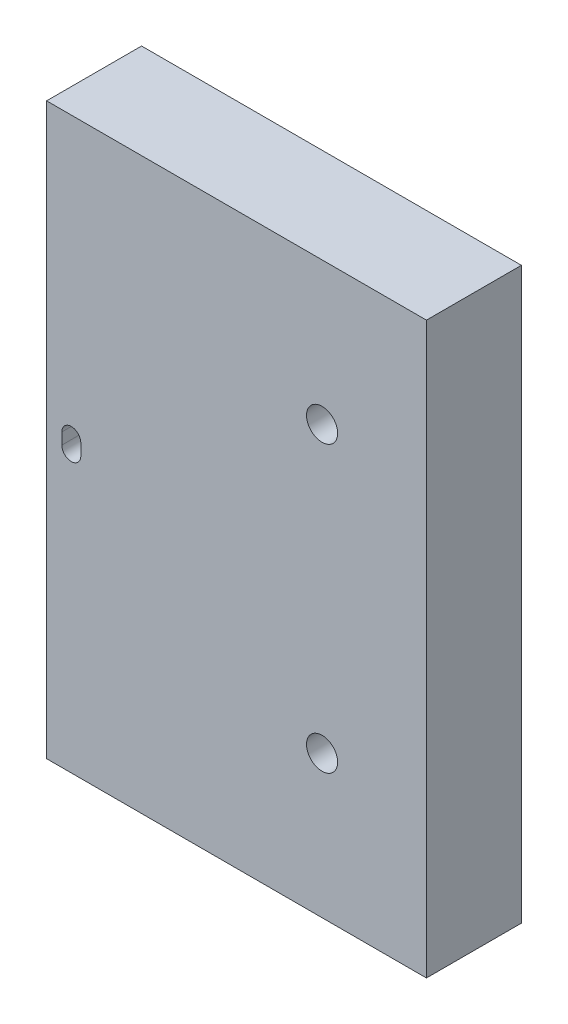
ISO-10303-21;
HEADER;
FILE_DESCRIPTION(('STEP AP214'),'2;1');
FILE_NAME('part.step','',(''),(''),'','','');
FILE_SCHEMA(('AUTOMOTIVE_DESIGN { 1 0 10303 214 1 1 1 1 }'));
ENDSEC;
DATA;
#1=APPLICATION_CONTEXT('core data for automotive mechanical design processes');
#2=APPLICATION_PROTOCOL_DEFINITION('international standard','automotive_design',2000,#1);
#3=PRODUCT_CONTEXT('',#1,'mechanical');
#4=PRODUCT('Part','Part','',(#3));
#5=PRODUCT_RELATED_PRODUCT_CATEGORY('part','',(#4));
#6=PRODUCT_DEFINITION_FORMATION('','',#4);
#7=PRODUCT_DEFINITION_CONTEXT('part definition',#1,'design');
#8=PRODUCT_DEFINITION('design','',#6,#7);
#9=PRODUCT_DEFINITION_SHAPE('','',#8);
#10=(LENGTH_UNIT() NAMED_UNIT(*) SI_UNIT(.MILLI.,.METRE.));
#11=(NAMED_UNIT(*) PLANE_ANGLE_UNIT() SI_UNIT($,.RADIAN.));
#12=(NAMED_UNIT(*) SI_UNIT($,.STERADIAN.) SOLID_ANGLE_UNIT());
#13=UNCERTAINTY_MEASURE_WITH_UNIT(LENGTH_MEASURE(1.E-05),#10,'distance_accuracy_value','');
#14=(GEOMETRIC_REPRESENTATION_CONTEXT(3) GLOBAL_UNCERTAINTY_ASSIGNED_CONTEXT((#13)) GLOBAL_UNIT_ASSIGNED_CONTEXT((#10,
#11,#12)) REPRESENTATION_CONTEXT('',''));
#15=CARTESIAN_POINT('',(0.,0.,0.));
#16=DIRECTION('',(0.,0.,1.));
#17=DIRECTION('',(1.,0.,0.));
#18=AXIS2_PLACEMENT_3D('',#15,#16,#17);
#19=CARTESIAN_POINT('',(12.7,-19.05,6.35));
#20=DIRECTION('',(-1.,0.,0.));
#21=DIRECTION('',(0.,0.,1.));
#22=AXIS2_PLACEMENT_3D('',#19,#20,#21);
#23=PLANE('',#22);
#24=DIRECTION('',(0.,1.,0.));
#25=VECTOR('',#24,1.);
#26=CARTESIAN_POINT('',(12.7,-19.05,0.));
#27=LINE('',#26,#25);
#28=CARTESIAN_POINT('',(12.7,-19.05,0.));
#29=VERTEX_POINT('',#28);
#30=CARTESIAN_POINT('',(12.7,19.05,0.));
#31=VERTEX_POINT('',#30);
#32=EDGE_CURVE('E154',#29,#31,#27,.T.);
#33=ORIENTED_EDGE('',*,*,#32,.T.);
#34=DIRECTION('',(0.,0.,-1.));
#35=VECTOR('',#34,1.);
#36=CARTESIAN_POINT('',(12.7,19.05,6.35));
#37=LINE('',#36,#35);
#38=CARTESIAN_POINT('',(12.7,19.05,6.35));
#39=VERTEX_POINT('',#38);
#40=EDGE_CURVE('E11',#39,#31,#37,.T.);
#41=ORIENTED_EDGE('',*,*,#40,.F.);
#42=DIRECTION('',(0.,1.,0.));
#43=VECTOR('',#42,1.);
#44=CARTESIAN_POINT('',(12.7,-19.05,6.35));
#45=LINE('',#44,#43);
#46=CARTESIAN_POINT('',(12.7,-19.05,6.35));
#47=VERTEX_POINT('',#46);
#48=EDGE_CURVE('E155',#47,#39,#45,.T.);
#49=ORIENTED_EDGE('',*,*,#48,.F.);
#50=DIRECTION('',(0.,0.,-1.));
#51=VECTOR('',#50,1.);
#52=CARTESIAN_POINT('',(12.7,-19.05,6.35));
#53=LINE('',#52,#51);
#54=EDGE_CURVE('E165',#47,#29,#53,.T.);
#55=ORIENTED_EDGE('',*,*,#54,.T.);
#56=EDGE_LOOP('',(#33,#41,#49,#55));
#57=FACE_BOUND('',#56,.T.);
#58=ADVANCED_FACE('F33',(#57),#23,.F.);
#59=CARTESIAN_POINT('',(-12.7,19.05,6.35));
#60=DIRECTION('',(0.,-1.,0.));
#61=DIRECTION('',(0.,0.,-1.));
#62=AXIS2_PLACEMENT_3D('',#59,#60,#61);
#63=PLANE('',#62);
#64=DIRECTION('',(-1.,0.,0.));
#65=VECTOR('',#64,1.);
#66=CARTESIAN_POINT('',(-12.7,19.05,0.));
#67=LINE('',#66,#65);
#68=CARTESIAN_POINT('',(-12.7,19.05,0.));
#69=VERTEX_POINT('',#68);
#70=EDGE_CURVE('E168',#31,#69,#67,.T.);
#71=ORIENTED_EDGE('',*,*,#70,.T.);
#72=DIRECTION('',(0.,0.,-1.));
#73=VECTOR('',#72,1.);
#74=CARTESIAN_POINT('',(-12.7,19.05,6.35));
#75=LINE('',#74,#73);
#76=CARTESIAN_POINT('',(-12.7,19.05,6.35));
#77=VERTEX_POINT('',#76);
#78=EDGE_CURVE('E40',#77,#69,#75,.T.);
#79=ORIENTED_EDGE('',*,*,#78,.F.);
#80=DIRECTION('',(-1.,0.,0.));
#81=VECTOR('',#80,1.);
#82=CARTESIAN_POINT('',(-12.7,19.05,6.35));
#83=LINE('',#82,#81);
#84=EDGE_CURVE('E158',#39,#77,#83,.T.);
#85=ORIENTED_EDGE('',*,*,#84,.F.);
#86=ORIENTED_EDGE('',*,*,#40,.T.);
#87=EDGE_LOOP('',(#71,#79,#85,#86));
#88=FACE_BOUND('',#87,.T.);
#89=ADVANCED_FACE('F196',(#88),#63,.F.);
#90=CARTESIAN_POINT('',(-12.7,-19.05,6.35));
#91=DIRECTION('',(1.,0.,0.));
#92=DIRECTION('',(0.,0.,-1.));
#93=AXIS2_PLACEMENT_3D('',#90,#91,#92);
#94=PLANE('',#93);
#95=CARTESIAN_POINT('',(-12.7,7.22499993410224,2.85000001645231));
#96=DIRECTION('',(-1.,0.,0.));
#97=DIRECTION('',(0.,0.,1.));
#98=AXIS2_PLACEMENT_3D('',#95,#96,#97);
#99=CIRCLE('',#98,1.0414);
#100=CARTESIAN_POINT('',(-12.7,7.22499993410224,3.89140001645231));
#101=VERTEX_POINT('',#100);
#102=EDGE_CURVE('E139',#101,#101,#99,.T.);
#103=ORIENTED_EDGE('',*,*,#102,.F.);
#104=EDGE_LOOP('',(#103));
#105=FACE_BOUND('',#104,.T.);
#106=CARTESIAN_POINT('',(-12.7,-11.7750000651044,2.84999952977158));
#107=DIRECTION('',(-1.,0.,0.));
#108=DIRECTION('',(0.,0.,1.));
#109=AXIS2_PLACEMENT_3D('',#106,#107,#108);
#110=CIRCLE('',#109,1.0414);
#111=CARTESIAN_POINT('',(-12.7,-11.7750000651044,3.89139952977158));
#112=VERTEX_POINT('',#111);
#113=EDGE_CURVE('E148',#112,#112,#110,.T.);
#114=ORIENTED_EDGE('',*,*,#113,.F.);
#115=EDGE_LOOP('',(#114));
#116=FACE_BOUND('',#115,.T.);
#117=DIRECTION('',(0.,-1.,0.));
#118=VECTOR('',#117,1.);
#119=CARTESIAN_POINT('',(-12.7,-19.05,0.));
#120=LINE('',#119,#118);
#121=CARTESIAN_POINT('',(-12.7,-19.05,0.));
#122=VERTEX_POINT('',#121);
#123=EDGE_CURVE('E170',#69,#122,#120,.T.);
#124=ORIENTED_EDGE('',*,*,#123,.T.);
#125=DIRECTION('',(0.,0.,-1.));
#126=VECTOR('',#125,1.);
#127=CARTESIAN_POINT('',(-12.7,-19.05,6.35));
#128=LINE('',#127,#126);
#129=CARTESIAN_POINT('',(-12.7,-19.05,6.35));
#130=VERTEX_POINT('',#129);
#131=EDGE_CURVE('E175',#130,#122,#128,.T.);
#132=ORIENTED_EDGE('',*,*,#131,.F.);
#133=DIRECTION('',(0.,-1.,0.));
#134=VECTOR('',#133,1.);
#135=CARTESIAN_POINT('',(-12.7,-19.05,6.35));
#136=LINE('',#135,#134);
#137=EDGE_CURVE('E161',#77,#130,#136,.T.);
#138=ORIENTED_EDGE('',*,*,#137,.F.);
#139=ORIENTED_EDGE('',*,*,#78,.T.);
#140=EDGE_LOOP('',(#124,#132,#138,#139));
#141=FACE_BOUND('',#140,.T.);
#142=ADVANCED_FACE('F182',(#105,#116,#141),#94,.F.);
#143=CARTESIAN_POINT('',(-12.7,-19.05,6.35));
#144=DIRECTION('',(0.,1.,0.));
#145=DIRECTION('',(0.,0.,1.));
#146=AXIS2_PLACEMENT_3D('',#143,#144,#145);
#147=PLANE('',#146);
#148=DIRECTION('',(1.,0.,0.));
#149=VECTOR('',#148,1.);
#150=CARTESIAN_POINT('',(-12.7,-19.05,0.));
#151=LINE('',#150,#149);
#152=EDGE_CURVE('E159',#122,#29,#151,.T.);
#153=ORIENTED_EDGE('',*,*,#152,.T.);
#154=ORIENTED_EDGE('',*,*,#54,.F.);
#155=DIRECTION('',(1.,0.,0.));
#156=VECTOR('',#155,1.);
#157=CARTESIAN_POINT('',(-12.7,-19.05,6.35));
#158=LINE('',#157,#156);
#159=EDGE_CURVE('E163',#130,#47,#158,.T.);
#160=ORIENTED_EDGE('',*,*,#159,.F.);
#161=ORIENTED_EDGE('',*,*,#131,.T.);
#162=EDGE_LOOP('',(#153,#154,#160,#161));
#163=FACE_BOUND('',#162,.T.);
#164=ADVANCED_FACE('F189',(#163),#147,.F.);
#165=CARTESIAN_POINT('',(0.,0.,6.35));
#166=DIRECTION('',(0.,0.,-1.));
#167=DIRECTION('',(-1.,0.,0.));
#168=AXIS2_PLACEMENT_3D('',#165,#166,#167);
#169=PLANE('',#168);
#170=CARTESIAN_POINT('',(5.72100000000001,9.525,6.35));
#171=DIRECTION('',(0.,0.,-1.));
#172=DIRECTION('',(-1.,0.,0.));
#173=AXIS2_PLACEMENT_3D('',#170,#171,#172);
#174=CIRCLE('',#173,1.04139999999999);
#175=CARTESIAN_POINT('',(4.67960000000002,9.525,6.35));
#176=VERTEX_POINT('',#175);
#177=EDGE_CURVE('E255',#176,#176,#174,.T.);
#178=ORIENTED_EDGE('',*,*,#177,.T.);
#179=EDGE_LOOP('',(#178));
#180=FACE_BOUND('',#179,.T.);
#181=CARTESIAN_POINT('',(5.72100000000001,-9.525,6.35));
#182=DIRECTION('',(0.,0.,-1.));
#183=DIRECTION('',(-1.,0.,0.));
#184=AXIS2_PLACEMENT_3D('',#181,#182,#183);
#185=CIRCLE('',#184,1.04139999999999);
#186=CARTESIAN_POINT('',(4.67960000000002,-9.525,6.35));
#187=VERTEX_POINT('',#186);
#188=EDGE_CURVE('E127',#187,#187,#185,.T.);
#189=ORIENTED_EDGE('',*,*,#188,.T.);
#190=EDGE_LOOP('',(#189));
#191=FACE_BOUND('',#190,.T.);
#192=DIRECTION('',(0.,-1.,0.));
#193=VECTOR('',#192,1.);
#194=CARTESIAN_POINT('',(-11.684,-0.381,6.35));
#195=LINE('',#194,#193);
#196=CARTESIAN_POINT('',(-11.684,0.381,6.35));
#197=VERTEX_POINT('',#196);
#198=CARTESIAN_POINT('',(-11.684,-0.381,6.35));
#199=VERTEX_POINT('',#198);
#200=EDGE_CURVE('E133',#197,#199,#195,.T.);
#201=ORIENTED_EDGE('',*,*,#200,.F.);
#202=CARTESIAN_POINT('',(-11.049,0.381,6.35));
#203=DIRECTION('',(0.,0.,1.));
#204=DIRECTION('',(1.,0.,0.));
#205=AXIS2_PLACEMENT_3D('',#202,#203,#204);
#206=CIRCLE('',#205,0.635);
#207=CARTESIAN_POINT('',(-10.414,0.381,6.35));
#208=VERTEX_POINT('',#207);
#209=EDGE_CURVE('E47',#208,#197,#206,.T.);
#210=ORIENTED_EDGE('',*,*,#209,.F.);
#211=DIRECTION('',(0.,1.,0.));
#212=VECTOR('',#211,1.);
#213=CARTESIAN_POINT('',(-10.414,-0.381,6.35));
#214=LINE('',#213,#212);
#215=CARTESIAN_POINT('',(-10.414,-0.381,6.35));
#216=VERTEX_POINT('',#215);
#217=EDGE_CURVE('E121',#216,#208,#214,.T.);
#218=ORIENTED_EDGE('',*,*,#217,.F.);
#219=CARTESIAN_POINT('',(-11.049,-0.381,6.35));
#220=DIRECTION('',(0.,0.,1.));
#221=DIRECTION('',(-1.,0.,0.));
#222=AXIS2_PLACEMENT_3D('',#219,#220,#221);
#223=CIRCLE('',#222,0.635);
#224=EDGE_CURVE('E124',#199,#216,#223,.T.);
#225=ORIENTED_EDGE('',*,*,#224,.F.);
#226=EDGE_LOOP('',(#201,#210,#218,#225));
#227=FACE_BOUND('',#226,.T.);
#228=ORIENTED_EDGE('',*,*,#48,.T.);
#229=ORIENTED_EDGE('',*,*,#84,.T.);
#230=ORIENTED_EDGE('',*,*,#137,.T.);
#231=ORIENTED_EDGE('',*,*,#159,.T.);
#232=EDGE_LOOP('',(#228,#229,#230,#231));
#233=FACE_BOUND('',#232,.T.);
#234=ADVANCED_FACE('F195',(#180,#191,#227,#233),#169,.F.);
#235=CARTESIAN_POINT('',(0.,0.,0.));
#236=DIRECTION('',(0.,0.,-1.));
#237=DIRECTION('',(-1.,0.,0.));
#238=AXIS2_PLACEMENT_3D('',#235,#236,#237);
#239=PLANE('',#238);
#240=CARTESIAN_POINT('',(5.72100000000001,9.525,0.));
#241=DIRECTION('',(0.,0.,-1.));
#242=DIRECTION('',(-1.,0.,0.));
#243=AXIS2_PLACEMENT_3D('',#240,#241,#242);
#244=CIRCLE('',#243,1.04139999999999);
#245=CARTESIAN_POINT('',(4.67960000000002,9.525,0.));
#246=VERTEX_POINT('',#245);
#247=EDGE_CURVE('E252',#246,#246,#244,.T.);
#248=ORIENTED_EDGE('',*,*,#247,.F.);
#249=EDGE_LOOP('',(#248));
#250=FACE_BOUND('',#249,.T.);
#251=CARTESIAN_POINT('',(5.72100000000001,-9.525,0.));
#252=DIRECTION('',(0.,0.,-1.));
#253=DIRECTION('',(-1.,0.,0.));
#254=AXIS2_PLACEMENT_3D('',#251,#252,#253);
#255=CIRCLE('',#254,1.04139999999999);
#256=CARTESIAN_POINT('',(4.67960000000002,-9.525,0.));
#257=VERTEX_POINT('',#256);
#258=EDGE_CURVE('E256',#257,#257,#255,.T.);
#259=ORIENTED_EDGE('',*,*,#258,.F.);
#260=EDGE_LOOP('',(#259));
#261=FACE_BOUND('',#260,.T.);
#262=CARTESIAN_POINT('',(-11.049,0.381,0.));
#263=DIRECTION('',(0.,0.,1.));
#264=DIRECTION('',(1.,0.,0.));
#265=AXIS2_PLACEMENT_3D('',#262,#263,#264);
#266=CIRCLE('',#265,0.635);
#267=CARTESIAN_POINT('',(-10.414,0.381,0.));
#268=VERTEX_POINT('',#267);
#269=CARTESIAN_POINT('',(-11.684,0.381,0.));
#270=VERTEX_POINT('',#269);
#271=EDGE_CURVE('E105',#268,#270,#266,.T.);
#272=ORIENTED_EDGE('',*,*,#271,.T.);
#273=DIRECTION('',(0.,-1.,0.));
#274=VECTOR('',#273,1.);
#275=CARTESIAN_POINT('',(-11.684,-0.381,0.));
#276=LINE('',#275,#274);
#277=CARTESIAN_POINT('',(-11.684,-0.381,0.));
#278=VERTEX_POINT('',#277);
#279=EDGE_CURVE('E114',#270,#278,#276,.T.);
#280=ORIENTED_EDGE('',*,*,#279,.T.);
#281=CARTESIAN_POINT('',(-11.049,-0.381,0.));
#282=DIRECTION('',(0.,0.,1.));
#283=DIRECTION('',(-1.,0.,0.));
#284=AXIS2_PLACEMENT_3D('',#281,#282,#283);
#285=CIRCLE('',#284,0.635);
#286=CARTESIAN_POINT('',(-10.414,-0.381,0.));
#287=VERTEX_POINT('',#286);
#288=EDGE_CURVE('E55',#278,#287,#285,.T.);
#289=ORIENTED_EDGE('',*,*,#288,.T.);
#290=DIRECTION('',(0.,1.,0.));
#291=VECTOR('',#290,1.);
#292=CARTESIAN_POINT('',(-10.414,-0.381,0.));
#293=LINE('',#292,#291);
#294=EDGE_CURVE('E111',#287,#268,#293,.T.);
#295=ORIENTED_EDGE('',*,*,#294,.T.);
#296=EDGE_LOOP('',(#272,#280,#289,#295));
#297=FACE_BOUND('',#296,.T.);
#298=ORIENTED_EDGE('',*,*,#32,.F.);
#299=ORIENTED_EDGE('',*,*,#152,.F.);
#300=ORIENTED_EDGE('',*,*,#123,.F.);
#301=ORIENTED_EDGE('',*,*,#70,.F.);
#302=EDGE_LOOP('',(#298,#299,#300,#301));
#303=FACE_BOUND('',#302,.T.);
#304=ADVANCED_FACE('F118',(#250,#261,#297,#303),#239,.T.);
#305=CARTESIAN_POINT('',(-5.08,-11.7750000651044,2.84999952977158));
#306=DIRECTION('',(-1.,0.,0.));
#307=DIRECTION('',(0.,0.,1.));
#308=AXIS2_PLACEMENT_3D('',#305,#306,#307);
#309=CONICAL_SURFACE('',#308,1.0414,1.02974425867665);
#310=CARTESIAN_POINT('',(-4.4542637513447,-11.7750000651044,2.84999952977158));
#311=VERTEX_POINT('',#310);
#312=VERTEX_LOOP('',#311);
#313=FACE_BOUND('',#312,.T.);
#314=CARTESIAN_POINT('',(-5.08,-11.7750000651044,2.84999952977158));
#315=DIRECTION('',(-1.,0.,0.));
#316=DIRECTION('',(0.,0.,1.));
#317=AXIS2_PLACEMENT_3D('',#314,#315,#316);
#318=CIRCLE('',#317,1.0414);
#319=CARTESIAN_POINT('',(-5.08,-11.7750000651044,3.89139952977157));
#320=VERTEX_POINT('',#319);
#321=EDGE_CURVE('E151',#320,#320,#318,.T.);
#322=ORIENTED_EDGE('',*,*,#321,.T.);
#323=EDGE_LOOP('',(#322));
#324=FACE_BOUND('',#323,.T.);
#325=ADVANCED_FACE('F209',(#313,#324),#309,.F.);
#326=CARTESIAN_POINT('',(-12.7,-11.7750000651044,2.84999952977158));
#327=DIRECTION('',(-1.,0.,0.));
#328=DIRECTION('',(0.,0.,1.));
#329=AXIS2_PLACEMENT_3D('',#326,#327,#328);
#330=CYLINDRICAL_SURFACE('',#329,1.0414);
#331=ORIENTED_EDGE('',*,*,#321,.F.);
#332=EDGE_LOOP('',(#331));
#333=FACE_BOUND('',#332,.T.);
#334=ORIENTED_EDGE('',*,*,#113,.T.);
#335=EDGE_LOOP('',(#334));
#336=FACE_BOUND('',#335,.T.);
#337=ADVANCED_FACE('F216',(#333,#336),#330,.F.);
#338=CARTESIAN_POINT('',(-5.08,7.22499993410224,2.85000001645231));
#339=DIRECTION('',(-1.,0.,0.));
#340=DIRECTION('',(0.,0.,1.));
#341=AXIS2_PLACEMENT_3D('',#338,#339,#340);
#342=CONICAL_SURFACE('',#341,1.0414,1.02974425867665);
#343=CARTESIAN_POINT('',(-4.4542637513447,7.22499993410224,2.85000001645231));
#344=VERTEX_POINT('',#343);
#345=VERTEX_LOOP('',#344);
#346=FACE_BOUND('',#345,.T.);
#347=CARTESIAN_POINT('',(-5.08,7.22499993410224,2.85000001645231));
#348=DIRECTION('',(-1.,0.,0.));
#349=DIRECTION('',(0.,0.,1.));
#350=AXIS2_PLACEMENT_3D('',#347,#348,#349);
#351=CIRCLE('',#350,1.0414);
#352=CARTESIAN_POINT('',(-5.08,7.22499993410224,3.89140001645231));
#353=VERTEX_POINT('',#352);
#354=EDGE_CURVE('E145',#353,#353,#351,.T.);
#355=ORIENTED_EDGE('',*,*,#354,.T.);
#356=EDGE_LOOP('',(#355));
#357=FACE_BOUND('',#356,.T.);
#358=ADVANCED_FACE('F220',(#346,#357),#342,.F.);
#359=CARTESIAN_POINT('',(-12.7,7.22499993410224,2.85000001645231));
#360=DIRECTION('',(-1.,0.,0.));
#361=DIRECTION('',(0.,0.,1.));
#362=AXIS2_PLACEMENT_3D('',#359,#360,#361);
#363=CYLINDRICAL_SURFACE('',#362,1.0414);
#364=ORIENTED_EDGE('',*,*,#354,.F.);
#365=EDGE_LOOP('',(#364));
#366=FACE_BOUND('',#365,.T.);
#367=ORIENTED_EDGE('',*,*,#102,.T.);
#368=EDGE_LOOP('',(#367));
#369=FACE_BOUND('',#368,.T.);
#370=ADVANCED_FACE('F224',(#366,#369),#363,.F.);
#371=CARTESIAN_POINT('',(-11.049,0.381,0.));
#372=DIRECTION('',(0.,0.,1.));
#373=DIRECTION('',(1.,0.,0.));
#374=AXIS2_PLACEMENT_3D('',#371,#372,#373);
#375=CYLINDRICAL_SURFACE('',#374,0.635);
#376=ORIENTED_EDGE('',*,*,#209,.T.);
#377=DIRECTION('',(0.,0.,1.));
#378=VECTOR('',#377,1.);
#379=CARTESIAN_POINT('',(-11.684,0.381,0.));
#380=LINE('',#379,#378);
#381=EDGE_CURVE('E101',#270,#197,#380,.T.);
#382=ORIENTED_EDGE('',*,*,#381,.F.);
#383=ORIENTED_EDGE('',*,*,#271,.F.);
#384=DIRECTION('',(0.,0.,1.));
#385=VECTOR('',#384,1.);
#386=CARTESIAN_POINT('',(-10.414,0.381,0.));
#387=LINE('',#386,#385);
#388=EDGE_CURVE('E137',#268,#208,#387,.T.);
#389=ORIENTED_EDGE('',*,*,#388,.T.);
#390=EDGE_LOOP('',(#376,#382,#383,#389));
#391=FACE_BOUND('',#390,.T.);
#392=ADVANCED_FACE('F103',(#391),#375,.F.);
#393=CARTESIAN_POINT('',(-10.414,-0.381,0.));
#394=DIRECTION('',(1.,0.,0.));
#395=DIRECTION('',(0.,0.,-1.));
#396=AXIS2_PLACEMENT_3D('',#393,#394,#395);
#397=PLANE('',#396);
#398=ORIENTED_EDGE('',*,*,#217,.T.);
#399=ORIENTED_EDGE('',*,*,#388,.F.);
#400=ORIENTED_EDGE('',*,*,#294,.F.);
#401=DIRECTION('',(0.,0.,1.));
#402=VECTOR('',#401,1.);
#403=CARTESIAN_POINT('',(-10.414,-0.381,0.));
#404=LINE('',#403,#402);
#405=EDGE_CURVE('E140',#287,#216,#404,.T.);
#406=ORIENTED_EDGE('',*,*,#405,.T.);
#407=EDGE_LOOP('',(#398,#399,#400,#406));
#408=FACE_BOUND('',#407,.T.);
#409=ADVANCED_FACE('F231',(#408),#397,.F.);
#410=CARTESIAN_POINT('',(-11.049,-0.381,0.));
#411=DIRECTION('',(0.,0.,1.));
#412=DIRECTION('',(1.,0.,0.));
#413=AXIS2_PLACEMENT_3D('',#410,#411,#412);
#414=CYLINDRICAL_SURFACE('',#413,0.635);
#415=ORIENTED_EDGE('',*,*,#224,.T.);
#416=ORIENTED_EDGE('',*,*,#405,.F.);
#417=ORIENTED_EDGE('',*,*,#288,.F.);
#418=DIRECTION('',(0.,0.,1.));
#419=VECTOR('',#418,1.);
#420=CARTESIAN_POINT('',(-11.684,-0.381,0.));
#421=LINE('',#420,#419);
#422=EDGE_CURVE('E110',#278,#199,#421,.T.);
#423=ORIENTED_EDGE('',*,*,#422,.T.);
#424=EDGE_LOOP('',(#415,#416,#417,#423));
#425=FACE_BOUND('',#424,.T.);
#426=ADVANCED_FACE('F235',(#425),#414,.F.);
#427=CARTESIAN_POINT('',(-11.684,-0.381,0.));
#428=DIRECTION('',(-1.,0.,0.));
#429=DIRECTION('',(0.,0.,1.));
#430=AXIS2_PLACEMENT_3D('',#427,#428,#429);
#431=PLANE('',#430);
#432=ORIENTED_EDGE('',*,*,#200,.T.);
#433=ORIENTED_EDGE('',*,*,#422,.F.);
#434=ORIENTED_EDGE('',*,*,#279,.F.);
#435=ORIENTED_EDGE('',*,*,#381,.T.);
#436=EDGE_LOOP('',(#432,#433,#434,#435));
#437=FACE_BOUND('',#436,.T.);
#438=ADVANCED_FACE('F115',(#437),#431,.F.);
#439=CARTESIAN_POINT('',(5.72100000000001,-9.525,0.));
#440=DIRECTION('',(0.,0.,-1.));
#441=DIRECTION('',(-1.,0.,0.));
#442=AXIS2_PLACEMENT_3D('',#439,#440,#441);
#443=CYLINDRICAL_SURFACE('',#442,1.04139999999999);
#444=ORIENTED_EDGE('',*,*,#258,.T.);
#445=EDGE_LOOP('',(#444));
#446=FACE_BOUND('',#445,.T.);
#447=ORIENTED_EDGE('',*,*,#188,.F.);
#448=EDGE_LOOP('',(#447));
#449=FACE_BOUND('',#448,.T.);
#450=ADVANCED_FACE('F234',(#446,#449),#443,.F.);
#451=CARTESIAN_POINT('',(5.72100000000001,9.525,0.));
#452=DIRECTION('',(0.,0.,-1.));
#453=DIRECTION('',(-1.,0.,0.));
#454=AXIS2_PLACEMENT_3D('',#451,#452,#453);
#455=CYLINDRICAL_SURFACE('',#454,1.04139999999999);
#456=ORIENTED_EDGE('',*,*,#247,.T.);
#457=EDGE_LOOP('',(#456));
#458=FACE_BOUND('',#457,.T.);
#459=ORIENTED_EDGE('',*,*,#177,.F.);
#460=EDGE_LOOP('',(#459));
#461=FACE_BOUND('',#460,.T.);
#462=ADVANCED_FACE('F243',(#458,#461),#455,.F.);
#463=CLOSED_SHELL('',(#58,#89,#142,#164,#234,#304,#325,#337,#358,#370,#392,#409,#426,#438,#450,#462));
#464=MANIFOLD_SOLID_BREP('B2',#463);
#465=ADVANCED_BREP_SHAPE_REPRESENTATION('',(#18,#464),#14);
#466=SHAPE_DEFINITION_REPRESENTATION(#9,#465);
ENDSEC;
END-ISO-10303-21;
